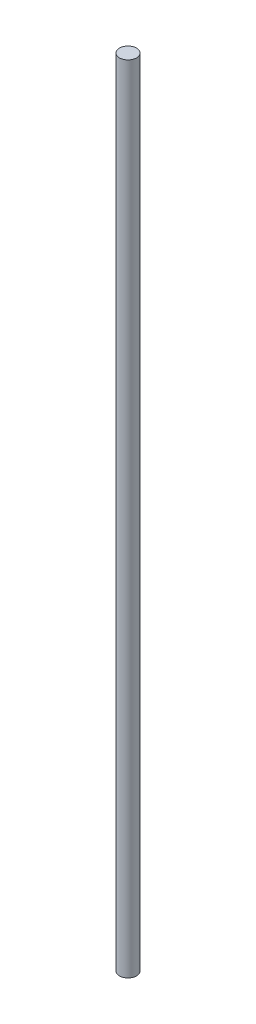
ISO-10303-21;
HEADER;
FILE_DESCRIPTION(('STEP AP214'),'2;1');
FILE_NAME('part.step','',(''),(''),'','','');
FILE_SCHEMA(('AUTOMOTIVE_DESIGN { 1 0 10303 214 1 1 1 1 }'));
ENDSEC;
DATA;
#1=APPLICATION_CONTEXT('core data for automotive mechanical design processes');
#2=APPLICATION_PROTOCOL_DEFINITION('international standard','automotive_design',2000,#1);
#3=PRODUCT_CONTEXT('',#1,'mechanical');
#4=PRODUCT('Part','Part','',(#3));
#5=PRODUCT_RELATED_PRODUCT_CATEGORY('part','',(#4));
#6=PRODUCT_DEFINITION_FORMATION('','',#4);
#7=PRODUCT_DEFINITION_CONTEXT('part definition',#1,'design');
#8=PRODUCT_DEFINITION('design','',#6,#7);
#9=PRODUCT_DEFINITION_SHAPE('','',#8);
#10=(LENGTH_UNIT() NAMED_UNIT(*) SI_UNIT(.MILLI.,.METRE.));
#11=(NAMED_UNIT(*) PLANE_ANGLE_UNIT() SI_UNIT($,.RADIAN.));
#12=(NAMED_UNIT(*) SI_UNIT($,.STERADIAN.) SOLID_ANGLE_UNIT());
#13=UNCERTAINTY_MEASURE_WITH_UNIT(LENGTH_MEASURE(1.E-05),#10,'distance_accuracy_value','');
#14=(GEOMETRIC_REPRESENTATION_CONTEXT(3) GLOBAL_UNCERTAINTY_ASSIGNED_CONTEXT((#13)) GLOBAL_UNIT_ASSIGNED_CONTEXT((#10,
#11,#12)) REPRESENTATION_CONTEXT('',''));
#15=CARTESIAN_POINT('',(0.,0.,0.));
#16=DIRECTION('',(0.,0.,1.));
#17=DIRECTION('',(1.,0.,0.));
#18=AXIS2_PLACEMENT_3D('',#15,#16,#17);
#19=CARTESIAN_POINT('',(0.,139.7,0.));
#20=DIRECTION('',(0.,-1.,0.));
#21=DIRECTION('',(0.,0.,-1.));
#22=AXIS2_PLACEMENT_3D('',#19,#20,#21);
#23=CYLINDRICAL_SURFACE('',#22,3.);
#24=CARTESIAN_POINT('',(0.,139.7,0.));
#25=DIRECTION('',(0.,1.,0.));
#26=DIRECTION('',(0.,0.,1.));
#27=AXIS2_PLACEMENT_3D('',#24,#25,#26);
#28=CIRCLE('',#27,3.);
#29=CARTESIAN_POINT('',(0.,139.7,3.));
#30=VERTEX_POINT('',#29);
#31=EDGE_CURVE('E10',#30,#30,#28,.T.);
#32=ORIENTED_EDGE('',*,*,#31,.F.);
#33=EDGE_LOOP('',(#32));
#34=FACE_BOUND('',#33,.T.);
#35=CARTESIAN_POINT('',(0.,-139.7,0.));
#36=DIRECTION('',(0.,1.,0.));
#37=DIRECTION('',(0.,0.,1.));
#38=AXIS2_PLACEMENT_3D('',#35,#36,#37);
#39=CIRCLE('',#38,3.);
#40=CARTESIAN_POINT('',(0.,-139.7,3.));
#41=VERTEX_POINT('',#40);
#42=EDGE_CURVE('E40',#41,#41,#39,.T.);
#43=ORIENTED_EDGE('',*,*,#42,.T.);
#44=EDGE_LOOP('',(#43));
#45=FACE_BOUND('',#44,.T.);
#46=ADVANCED_FACE('F37',(#34,#45),#23,.T.);
#47=CARTESIAN_POINT('',(0.,139.7,0.));
#48=DIRECTION('',(0.,1.,0.));
#49=DIRECTION('',(0.,0.,1.));
#50=AXIS2_PLACEMENT_3D('',#47,#48,#49);
#51=PLANE('',#50);
#52=ORIENTED_EDGE('',*,*,#31,.T.);
#53=EDGE_LOOP('',(#52));
#54=FACE_BOUND('',#53,.T.);
#55=ADVANCED_FACE('F52',(#54),#51,.T.);
#56=CARTESIAN_POINT('',(0.,-139.7,0.));
#57=DIRECTION('',(0.,1.,0.));
#58=DIRECTION('',(0.,0.,1.));
#59=AXIS2_PLACEMENT_3D('',#56,#57,#58);
#60=PLANE('',#59);
#61=ORIENTED_EDGE('',*,*,#42,.F.);
#62=EDGE_LOOP('',(#61));
#63=FACE_BOUND('',#62,.T.);
#64=ADVANCED_FACE('F50',(#63),#60,.F.);
#65=CLOSED_SHELL('',(#46,#55,#64));
#66=MANIFOLD_SOLID_BREP('B2',#65);
#67=ADVANCED_BREP_SHAPE_REPRESENTATION('',(#18,#66),#14);
#68=SHAPE_DEFINITION_REPRESENTATION(#9,#67);
ENDSEC;
END-ISO-10303-21;
